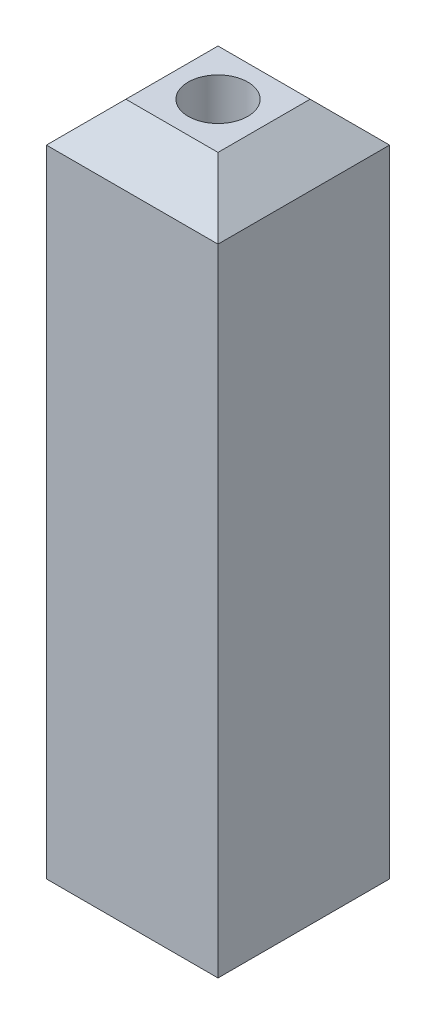
ISO-10303-21;
HEADER;
FILE_DESCRIPTION(('STEP AP214'),'2;1');
FILE_NAME('part.step','',(''),(''),'','','');
FILE_SCHEMA(('AUTOMOTIVE_DESIGN { 1 0 10303 214 1 1 1 1 }'));
ENDSEC;
DATA;
#1=APPLICATION_CONTEXT('core data for automotive mechanical design processes');
#2=APPLICATION_PROTOCOL_DEFINITION('international standard','automotive_design',2000,#1);
#3=PRODUCT_CONTEXT('',#1,'mechanical');
#4=PRODUCT('Part','Part','',(#3));
#5=PRODUCT_RELATED_PRODUCT_CATEGORY('part','',(#4));
#6=PRODUCT_DEFINITION_FORMATION('','',#4);
#7=PRODUCT_DEFINITION_CONTEXT('part definition',#1,'design');
#8=PRODUCT_DEFINITION('design','',#6,#7);
#9=PRODUCT_DEFINITION_SHAPE('','',#8);
#10=(LENGTH_UNIT() NAMED_UNIT(*) SI_UNIT(.MILLI.,.METRE.));
#11=(NAMED_UNIT(*) PLANE_ANGLE_UNIT() SI_UNIT($,.RADIAN.));
#12=(NAMED_UNIT(*) SI_UNIT($,.STERADIAN.) SOLID_ANGLE_UNIT());
#13=UNCERTAINTY_MEASURE_WITH_UNIT(LENGTH_MEASURE(1.E-05),#10,'distance_accuracy_value','');
#14=(GEOMETRIC_REPRESENTATION_CONTEXT(3) GLOBAL_UNCERTAINTY_ASSIGNED_CONTEXT((#13)) GLOBAL_UNIT_ASSIGNED_CONTEXT((#10,
#11,#12)) REPRESENTATION_CONTEXT('',''));
#15=CARTESIAN_POINT('',(0.,0.,0.));
#16=DIRECTION('',(0.,0.,1.));
#17=DIRECTION('',(1.,0.,0.));
#18=AXIS2_PLACEMENT_3D('',#15,#16,#17);
#19=CARTESIAN_POINT('',(-27.432,215.9,-27.432));
#20=DIRECTION('',(0.,0.,-1.));
#21=DIRECTION('',(-1.,0.,0.));
#22=AXIS2_PLACEMENT_3D('',#19,#20,#21);
#23=PLANE('',#22);
#24=DIRECTION('',(0.,-1.,0.));
#25=VECTOR('',#24,1.);
#26=CARTESIAN_POINT('',(-27.432,215.9,-27.432));
#27=LINE('',#26,#25);
#28=CARTESIAN_POINT('',(-27.432,203.2,-27.432));
#29=VERTEX_POINT('',#28);
#30=CARTESIAN_POINT('',(-27.432,0.,-27.432));
#31=VERTEX_POINT('',#30);
#32=EDGE_CURVE('E161',#29,#31,#27,.T.);
#33=ORIENTED_EDGE('',*,*,#32,.F.);
#34=DIRECTION('',(1.,0.,0.));
#35=VECTOR('',#34,1.);
#36=CARTESIAN_POINT('',(27.432,203.2,-27.432));
#37=LINE('',#36,#35);
#38=CARTESIAN_POINT('',(27.432,203.2,-27.432));
#39=VERTEX_POINT('',#38);
#40=EDGE_CURVE('E11',#29,#39,#37,.T.);
#41=ORIENTED_EDGE('',*,*,#40,.T.);
#42=DIRECTION('',(0.,-1.,0.));
#43=VECTOR('',#42,1.);
#44=CARTESIAN_POINT('',(27.432,215.9,-27.432));
#45=LINE('',#44,#43);
#46=CARTESIAN_POINT('',(27.432,0.,-27.432));
#47=VERTEX_POINT('',#46);
#48=EDGE_CURVE('E160',#39,#47,#45,.T.);
#49=ORIENTED_EDGE('',*,*,#48,.T.);
#50=DIRECTION('',(1.,0.,0.));
#51=VECTOR('',#50,1.);
#52=CARTESIAN_POINT('',(-27.432,0.,-27.432));
#53=LINE('',#52,#51);
#54=EDGE_CURVE('E148',#31,#47,#53,.T.);
#55=ORIENTED_EDGE('',*,*,#54,.F.);
#56=EDGE_LOOP('',(#33,#41,#49,#55));
#57=FACE_BOUND('',#56,.T.);
#58=ADVANCED_FACE('F33',(#57),#23,.T.);
#59=CARTESIAN_POINT('',(-27.432,215.9,-27.432));
#60=DIRECTION('',(1.,0.,0.));
#61=DIRECTION('',(0.,0.,-1.));
#62=AXIS2_PLACEMENT_3D('',#59,#60,#61);
#63=PLANE('',#62);
#64=DIRECTION('',(0.,-1.,0.));
#65=VECTOR('',#64,1.);
#66=CARTESIAN_POINT('',(-27.432,215.9,27.432));
#67=LINE('',#66,#65);
#68=CARTESIAN_POINT('',(-27.432,203.2,27.432));
#69=VERTEX_POINT('',#68);
#70=CARTESIAN_POINT('',(-27.432,0.,27.432));
#71=VERTEX_POINT('',#70);
#72=EDGE_CURVE('E164',#69,#71,#67,.T.);
#73=ORIENTED_EDGE('',*,*,#72,.F.);
#74=DIRECTION('',(0.,0.,-1.));
#75=VECTOR('',#74,1.);
#76=CARTESIAN_POINT('',(-27.432,203.2,-27.432));
#77=LINE('',#76,#75);
#78=EDGE_CURVE('E56',#69,#29,#77,.T.);
#79=ORIENTED_EDGE('',*,*,#78,.T.);
#80=ORIENTED_EDGE('',*,*,#32,.T.);
#81=DIRECTION('',(0.,0.,1.));
#82=VECTOR('',#81,1.);
#83=CARTESIAN_POINT('',(-27.432,0.,-27.432));
#84=LINE('',#83,#82);
#85=EDGE_CURVE('E157',#31,#71,#84,.T.);
#86=ORIENTED_EDGE('',*,*,#85,.T.);
#87=EDGE_LOOP('',(#73,#79,#80,#86));
#88=FACE_BOUND('',#87,.T.);
#89=ADVANCED_FACE('F226',(#88),#63,.F.);
#90=CARTESIAN_POINT('',(-27.432,215.9,27.432));
#91=DIRECTION('',(0.,0.,-1.));
#92=DIRECTION('',(-1.,0.,0.));
#93=AXIS2_PLACEMENT_3D('',#90,#91,#92);
#94=PLANE('',#93);
#95=DIRECTION('',(0.,-1.,0.));
#96=VECTOR('',#95,1.);
#97=CARTESIAN_POINT('',(27.432,215.9,27.432));
#98=LINE('',#97,#96);
#99=CARTESIAN_POINT('',(27.432,203.2,27.432));
#100=VERTEX_POINT('',#99);
#101=CARTESIAN_POINT('',(27.432,0.,27.432));
#102=VERTEX_POINT('',#101);
#103=EDGE_CURVE('E166',#100,#102,#98,.T.);
#104=ORIENTED_EDGE('',*,*,#103,.F.);
#105=DIRECTION('',(-1.,0.,0.));
#106=VECTOR('',#105,1.);
#107=CARTESIAN_POINT('',(-27.432,203.2,27.432));
#108=LINE('',#107,#106);
#109=EDGE_CURVE('E177',#100,#69,#108,.T.);
#110=ORIENTED_EDGE('',*,*,#109,.T.);
#111=ORIENTED_EDGE('',*,*,#72,.T.);
#112=DIRECTION('',(1.,0.,0.));
#113=VECTOR('',#112,1.);
#114=CARTESIAN_POINT('',(-27.432,0.,27.432));
#115=LINE('',#114,#113);
#116=EDGE_CURVE('E154',#71,#102,#115,.T.);
#117=ORIENTED_EDGE('',*,*,#116,.T.);
#118=EDGE_LOOP('',(#104,#110,#111,#117));
#119=FACE_BOUND('',#118,.T.);
#120=ADVANCED_FACE('F207',(#119),#94,.F.);
#121=CARTESIAN_POINT('',(27.432,215.9,-27.432));
#122=DIRECTION('',(1.,0.,0.));
#123=DIRECTION('',(0.,0.,-1.));
#124=AXIS2_PLACEMENT_3D('',#121,#122,#123);
#125=PLANE('',#124);
#126=ORIENTED_EDGE('',*,*,#48,.F.);
#127=DIRECTION('',(0.,0.,1.));
#128=VECTOR('',#127,1.);
#129=CARTESIAN_POINT('',(27.432,203.2,27.432));
#130=LINE('',#129,#128);
#131=EDGE_CURVE('E42',#39,#100,#130,.T.);
#132=ORIENTED_EDGE('',*,*,#131,.T.);
#133=ORIENTED_EDGE('',*,*,#103,.T.);
#134=DIRECTION('',(0.,0.,1.));
#135=VECTOR('',#134,1.);
#136=CARTESIAN_POINT('',(27.432,0.,-27.432));
#137=LINE('',#136,#135);
#138=EDGE_CURVE('E151',#47,#102,#137,.T.);
#139=ORIENTED_EDGE('',*,*,#138,.F.);
#140=EDGE_LOOP('',(#126,#132,#133,#139));
#141=FACE_BOUND('',#140,.T.);
#142=ADVANCED_FACE('F203',(#141),#125,.T.);
#143=CARTESIAN_POINT('',(0.,215.9,0.));
#144=DIRECTION('',(0.,-1.,0.));
#145=DIRECTION('',(0.,0.,-1.));
#146=AXIS2_PLACEMENT_3D('',#143,#144,#145);
#147=PLANE('',#146);
#148=DIRECTION('',(0.,0.,1.));
#149=VECTOR('',#148,1.);
#150=CARTESIAN_POINT('',(-14.7319999999999,215.9,0.));
#151=LINE('',#150,#149);
#152=CARTESIAN_POINT('',(-14.7319999999999,215.9,-14.7319999999999));
#153=VERTEX_POINT('',#152);
#154=CARTESIAN_POINT('',(-14.7319999999999,215.9,14.7319999999999));
#155=VERTEX_POINT('',#154);
#156=EDGE_CURVE('E172',#153,#155,#151,.T.);
#157=ORIENTED_EDGE('',*,*,#156,.T.);
#158=DIRECTION('',(1.,0.,0.));
#159=VECTOR('',#158,1.);
#160=CARTESIAN_POINT('',(0.,215.9,14.7319999999999));
#161=LINE('',#160,#159);
#162=CARTESIAN_POINT('',(14.7319999999999,215.9,14.7319999999999));
#163=VERTEX_POINT('',#162);
#164=EDGE_CURVE('E174',#155,#163,#161,.T.);
#165=ORIENTED_EDGE('',*,*,#164,.T.);
#166=DIRECTION('',(0.,0.,-1.));
#167=VECTOR('',#166,1.);
#168=CARTESIAN_POINT('',(14.7319999999999,215.9,-27.432));
#169=LINE('',#168,#167);
#170=CARTESIAN_POINT('',(14.7319999999999,215.9,-14.7319999999999));
#171=VERTEX_POINT('',#170);
#172=EDGE_CURVE('E170',#163,#171,#169,.T.);
#173=ORIENTED_EDGE('',*,*,#172,.T.);
#174=DIRECTION('',(-1.,0.,0.));
#175=VECTOR('',#174,1.);
#176=CARTESIAN_POINT('',(-27.432,215.9,-14.7319999999999));
#177=LINE('',#176,#175);
#178=EDGE_CURVE('E163',#171,#153,#177,.T.);
#179=ORIENTED_EDGE('',*,*,#178,.T.);
#180=EDGE_LOOP('',(#157,#165,#173,#179));
#181=FACE_BOUND('',#180,.T.);
#182=CARTESIAN_POINT('',(0.,215.9,0.));
#183=DIRECTION('',(0.,1.,0.));
#184=DIRECTION('',(0.,0.,1.));
#185=AXIS2_PLACEMENT_3D('',#182,#183,#184);
#186=CIRCLE('',#185,9.52499999999998);
#187=CARTESIAN_POINT('',(0.,215.9,9.52499999999998));
#188=VERTEX_POINT('',#187);
#189=EDGE_CURVE('E114',#188,#188,#186,.T.);
#190=ORIENTED_EDGE('',*,*,#189,.F.);
#191=EDGE_LOOP('',(#190));
#192=FACE_BOUND('',#191,.T.);
#193=ADVANCED_FACE('F213',(#181,#192),#147,.F.);
#194=CARTESIAN_POINT('',(0.,0.,0.));
#195=DIRECTION('',(0.,-1.,0.));
#196=DIRECTION('',(0.,0.,-1.));
#197=AXIS2_PLACEMENT_3D('',#194,#195,#196);
#198=PLANE('',#197);
#199=CARTESIAN_POINT('',(-23.622,0.,23.622));
#200=DIRECTION('',(0.,-1.,0.));
#201=DIRECTION('',(0.,0.,-1.));
#202=AXIS2_PLACEMENT_3D('',#199,#200,#201);
#203=CIRCLE('',#202,2.57975099999998);
#204=CARTESIAN_POINT('',(-23.622,0.,21.042249));
#205=VERTEX_POINT('',#204);
#206=EDGE_CURVE('E113',#205,#205,#203,.T.);
#207=ORIENTED_EDGE('',*,*,#206,.F.);
#208=EDGE_LOOP('',(#207));
#209=FACE_BOUND('',#208,.T.);
#210=CARTESIAN_POINT('',(23.622,0.,23.622));
#211=DIRECTION('',(0.,-1.,0.));
#212=DIRECTION('',(0.,0.,-1.));
#213=AXIS2_PLACEMENT_3D('',#210,#211,#212);
#214=CIRCLE('',#213,2.57975099999998);
#215=CARTESIAN_POINT('',(23.622,0.,21.042249));
#216=VERTEX_POINT('',#215);
#217=EDGE_CURVE('E124',#216,#216,#214,.T.);
#218=ORIENTED_EDGE('',*,*,#217,.F.);
#219=EDGE_LOOP('',(#218));
#220=FACE_BOUND('',#219,.T.);
#221=CARTESIAN_POINT('',(23.622,0.,-23.622));
#222=DIRECTION('',(0.,-1.,0.));
#223=DIRECTION('',(0.,0.,-1.));
#224=AXIS2_PLACEMENT_3D('',#221,#222,#223);
#225=CIRCLE('',#224,2.57975099999998);
#226=CARTESIAN_POINT('',(23.622,0.,-26.201751));
#227=VERTEX_POINT('',#226);
#228=EDGE_CURVE('E130',#227,#227,#225,.T.);
#229=ORIENTED_EDGE('',*,*,#228,.F.);
#230=EDGE_LOOP('',(#229));
#231=FACE_BOUND('',#230,.T.);
#232=CARTESIAN_POINT('',(-23.622,0.,-23.622));
#233=DIRECTION('',(0.,-1.,0.));
#234=DIRECTION('',(0.,0.,-1.));
#235=AXIS2_PLACEMENT_3D('',#232,#233,#234);
#236=CIRCLE('',#235,2.57975099999998);
#237=CARTESIAN_POINT('',(-23.622,0.,-26.201751));
#238=VERTEX_POINT('',#237);
#239=EDGE_CURVE('E136',#238,#238,#236,.T.);
#240=ORIENTED_EDGE('',*,*,#239,.F.);
#241=EDGE_LOOP('',(#240));
#242=FACE_BOUND('',#241,.T.);
#243=CARTESIAN_POINT('',(0.,0.,0.));
#244=DIRECTION('',(0.,-1.,0.));
#245=DIRECTION('',(0.,0.,-1.));
#246=AXIS2_PLACEMENT_3D('',#243,#244,#245);
#247=CIRCLE('',#246,9.52499999999999);
#248=CARTESIAN_POINT('',(0.,0.,-9.52499999999999));
#249=VERTEX_POINT('',#248);
#250=EDGE_CURVE('E142',#249,#249,#247,.T.);
#251=ORIENTED_EDGE('',*,*,#250,.F.);
#252=EDGE_LOOP('',(#251));
#253=FACE_BOUND('',#252,.T.);
#254=ORIENTED_EDGE('',*,*,#54,.T.);
#255=ORIENTED_EDGE('',*,*,#138,.T.);
#256=ORIENTED_EDGE('',*,*,#116,.F.);
#257=ORIENTED_EDGE('',*,*,#85,.F.);
#258=EDGE_LOOP('',(#254,#255,#256,#257));
#259=FACE_BOUND('',#258,.T.);
#260=ADVANCED_FACE('F216',(#209,#220,#231,#242,#253,#259),#198,.T.);
#261=CARTESIAN_POINT('',(0.,152.4,0.));
#262=DIRECTION('',(0.,-1.,0.));
#263=DIRECTION('',(0.,0.,-1.));
#264=AXIS2_PLACEMENT_3D('',#261,#262,#263);
#265=CONICAL_SURFACE('',#264,9.52499999999998,1.02974425867665);
#266=CARTESIAN_POINT('',(0.,158.123197396238,0.));
#267=VERTEX_POINT('',#266);
#268=VERTEX_LOOP('',#267);
#269=FACE_BOUND('',#268,.T.);
#270=CARTESIAN_POINT('',(0.,152.4,0.));
#271=DIRECTION('',(0.,-1.,0.));
#272=DIRECTION('',(0.,0.,-1.));
#273=AXIS2_PLACEMENT_3D('',#270,#271,#272);
#274=CIRCLE('',#273,9.52499999999998);
#275=CARTESIAN_POINT('',(0.,152.4,-9.52499999999998));
#276=VERTEX_POINT('',#275);
#277=EDGE_CURVE('E145',#276,#276,#274,.T.);
#278=ORIENTED_EDGE('',*,*,#277,.T.);
#279=EDGE_LOOP('',(#278));
#280=FACE_BOUND('',#279,.T.);
#281=ADVANCED_FACE('F351',(#269,#280),#265,.F.);
#282=CARTESIAN_POINT('',(0.,0.,0.));
#283=DIRECTION('',(0.,-1.,0.));
#284=DIRECTION('',(0.,0.,-1.));
#285=AXIS2_PLACEMENT_3D('',#282,#283,#284);
#286=CYLINDRICAL_SURFACE('',#285,9.52499999999998);
#287=ORIENTED_EDGE('',*,*,#277,.F.);
#288=EDGE_LOOP('',(#287));
#289=FACE_BOUND('',#288,.T.);
#290=ORIENTED_EDGE('',*,*,#250,.T.);
#291=EDGE_LOOP('',(#290));
#292=FACE_BOUND('',#291,.T.);
#293=ADVANCED_FACE('F341',(#289,#292),#286,.F.);
#294=CARTESIAN_POINT('',(-23.622,152.4,-23.622));
#295=DIRECTION('',(0.,-1.,0.));
#296=DIRECTION('',(0.,0.,-1.));
#297=AXIS2_PLACEMENT_3D('',#294,#295,#296);
#298=CONICAL_SURFACE('',#297,2.57975099999996,1.02974425867664);
#299=CARTESIAN_POINT('',(-23.622,153.950070782797,-23.622));
#300=VERTEX_POINT('',#299);
#301=VERTEX_LOOP('',#300);
#302=FACE_BOUND('',#301,.T.);
#303=CARTESIAN_POINT('',(-23.622,152.4,-23.622));
#304=DIRECTION('',(0.,-1.,0.));
#305=DIRECTION('',(0.,0.,-1.));
#306=AXIS2_PLACEMENT_3D('',#303,#304,#305);
#307=CIRCLE('',#306,2.57975099999996);
#308=CARTESIAN_POINT('',(-23.622,152.4,-26.201751));
#309=VERTEX_POINT('',#308);
#310=EDGE_CURVE('E139',#309,#309,#307,.T.);
#311=ORIENTED_EDGE('',*,*,#310,.T.);
#312=EDGE_LOOP('',(#311));
#313=FACE_BOUND('',#312,.T.);
#314=ADVANCED_FACE('F332',(#302,#313),#298,.F.);
#315=CARTESIAN_POINT('',(-23.622,0.,-23.622));
#316=DIRECTION('',(0.,-1.,0.));
#317=DIRECTION('',(0.,0.,-1.));
#318=AXIS2_PLACEMENT_3D('',#315,#316,#317);
#319=CYLINDRICAL_SURFACE('',#318,2.57975099999997);
#320=ORIENTED_EDGE('',*,*,#310,.F.);
#321=EDGE_LOOP('',(#320));
#322=FACE_BOUND('',#321,.T.);
#323=ORIENTED_EDGE('',*,*,#239,.T.);
#324=EDGE_LOOP('',(#323));
#325=FACE_BOUND('',#324,.T.);
#326=ADVANCED_FACE('F323',(#322,#325),#319,.F.);
#327=CARTESIAN_POINT('',(23.622,152.4,-23.622));
#328=DIRECTION('',(0.,-1.,0.));
#329=DIRECTION('',(0.,0.,-1.));
#330=AXIS2_PLACEMENT_3D('',#327,#328,#329);
#331=CONICAL_SURFACE('',#330,2.57975099999996,1.02974425867664);
#332=CARTESIAN_POINT('',(23.622,153.950070782797,-23.622));
#333=VERTEX_POINT('',#332);
#334=VERTEX_LOOP('',#333);
#335=FACE_BOUND('',#334,.T.);
#336=CARTESIAN_POINT('',(23.622,152.4,-23.622));
#337=DIRECTION('',(0.,-1.,0.));
#338=DIRECTION('',(0.,0.,-1.));
#339=AXIS2_PLACEMENT_3D('',#336,#337,#338);
#340=CIRCLE('',#339,2.57975099999996);
#341=CARTESIAN_POINT('',(23.622,152.4,-26.201751));
#342=VERTEX_POINT('',#341);
#343=EDGE_CURVE('E133',#342,#342,#340,.T.);
#344=ORIENTED_EDGE('',*,*,#343,.T.);
#345=EDGE_LOOP('',(#344));
#346=FACE_BOUND('',#345,.T.);
#347=ADVANCED_FACE('F314',(#335,#346),#331,.F.);
#348=CARTESIAN_POINT('',(23.622,0.,-23.622));
#349=DIRECTION('',(0.,-1.,0.));
#350=DIRECTION('',(0.,0.,-1.));
#351=AXIS2_PLACEMENT_3D('',#348,#349,#350);
#352=CYLINDRICAL_SURFACE('',#351,2.57975099999997);
#353=ORIENTED_EDGE('',*,*,#343,.F.);
#354=EDGE_LOOP('',(#353));
#355=FACE_BOUND('',#354,.T.);
#356=ORIENTED_EDGE('',*,*,#228,.T.);
#357=EDGE_LOOP('',(#356));
#358=FACE_BOUND('',#357,.T.);
#359=ADVANCED_FACE('F305',(#355,#358),#352,.F.);
#360=CARTESIAN_POINT('',(23.622,152.4,23.622));
#361=DIRECTION('',(0.,-1.,0.));
#362=DIRECTION('',(0.,0.,-1.));
#363=AXIS2_PLACEMENT_3D('',#360,#361,#362);
#364=CONICAL_SURFACE('',#363,2.57975099999996,1.02974425867664);
#365=CARTESIAN_POINT('',(23.622,153.950070782797,23.622));
#366=VERTEX_POINT('',#365);
#367=VERTEX_LOOP('',#366);
#368=FACE_BOUND('',#367,.T.);
#369=CARTESIAN_POINT('',(23.622,152.4,23.622));
#370=DIRECTION('',(0.,-1.,0.));
#371=DIRECTION('',(0.,0.,-1.));
#372=AXIS2_PLACEMENT_3D('',#369,#370,#371);
#373=CIRCLE('',#372,2.57975099999996);
#374=CARTESIAN_POINT('',(23.622,152.4,21.042249));
#375=VERTEX_POINT('',#374);
#376=EDGE_CURVE('E127',#375,#375,#373,.T.);
#377=ORIENTED_EDGE('',*,*,#376,.T.);
#378=EDGE_LOOP('',(#377));
#379=FACE_BOUND('',#378,.T.);
#380=ADVANCED_FACE('F296',(#368,#379),#364,.F.);
#381=CARTESIAN_POINT('',(23.622,0.,23.622));
#382=DIRECTION('',(0.,-1.,0.));
#383=DIRECTION('',(0.,0.,-1.));
#384=AXIS2_PLACEMENT_3D('',#381,#382,#383);
#385=CYLINDRICAL_SURFACE('',#384,2.57975099999997);
#386=ORIENTED_EDGE('',*,*,#376,.F.);
#387=EDGE_LOOP('',(#386));
#388=FACE_BOUND('',#387,.T.);
#389=ORIENTED_EDGE('',*,*,#217,.T.);
#390=EDGE_LOOP('',(#389));
#391=FACE_BOUND('',#390,.T.);
#392=ADVANCED_FACE('F287',(#388,#391),#385,.F.);
#393=CARTESIAN_POINT('',(-23.622,152.4,23.622));
#394=DIRECTION('',(0.,-1.,0.));
#395=DIRECTION('',(0.,0.,-1.));
#396=AXIS2_PLACEMENT_3D('',#393,#394,#395);
#397=CONICAL_SURFACE('',#396,2.57975099999996,1.02974425867664);
#398=CARTESIAN_POINT('',(-23.622,153.950070782797,23.622));
#399=VERTEX_POINT('',#398);
#400=VERTEX_LOOP('',#399);
#401=FACE_BOUND('',#400,.T.);
#402=CARTESIAN_POINT('',(-23.622,152.4,23.622));
#403=DIRECTION('',(0.,-1.,0.));
#404=DIRECTION('',(0.,0.,-1.));
#405=AXIS2_PLACEMENT_3D('',#402,#403,#404);
#406=CIRCLE('',#405,2.57975099999996);
#407=CARTESIAN_POINT('',(-23.622,152.4,21.042249));
#408=VERTEX_POINT('',#407);
#409=EDGE_CURVE('E117',#408,#408,#406,.T.);
#410=ORIENTED_EDGE('',*,*,#409,.T.);
#411=EDGE_LOOP('',(#410));
#412=FACE_BOUND('',#411,.T.);
#413=ADVANCED_FACE('F278',(#401,#412),#397,.F.);
#414=CARTESIAN_POINT('',(-23.622,0.,23.622));
#415=DIRECTION('',(0.,-1.,0.));
#416=DIRECTION('',(0.,0.,-1.));
#417=AXIS2_PLACEMENT_3D('',#414,#415,#416);
#418=CYLINDRICAL_SURFACE('',#417,2.57975099999997);
#419=ORIENTED_EDGE('',*,*,#409,.F.);
#420=EDGE_LOOP('',(#419));
#421=FACE_BOUND('',#420,.T.);
#422=ORIENTED_EDGE('',*,*,#206,.T.);
#423=EDGE_LOOP('',(#422));
#424=FACE_BOUND('',#423,.T.);
#425=ADVANCED_FACE('F107',(#421,#424),#418,.F.);
#426=CARTESIAN_POINT('',(0.,173.355,0.));
#427=DIRECTION('',(0.,1.,0.));
#428=DIRECTION('',(0.,0.,1.));
#429=AXIS2_PLACEMENT_3D('',#426,#427,#428);
#430=CONICAL_SURFACE('',#429,9.52499999999997,1.02974425867665);
#431=CARTESIAN_POINT('',(0.,167.631802603762,0.));
#432=VERTEX_POINT('',#431);
#433=VERTEX_LOOP('',#432);
#434=FACE_BOUND('',#433,.T.);
#435=CARTESIAN_POINT('',(0.,173.355,0.));
#436=DIRECTION('',(0.,1.,0.));
#437=DIRECTION('',(0.,0.,1.));
#438=AXIS2_PLACEMENT_3D('',#435,#436,#437);
#439=CIRCLE('',#438,9.52499999999997);
#440=CARTESIAN_POINT('',(0.,173.355,9.52499999999997));
#441=VERTEX_POINT('',#440);
#442=EDGE_CURVE('E111',#441,#441,#439,.T.);
#443=ORIENTED_EDGE('',*,*,#442,.T.);
#444=EDGE_LOOP('',(#443));
#445=FACE_BOUND('',#444,.T.);
#446=ADVANCED_FACE('F103',(#434,#445),#430,.F.);
#447=CARTESIAN_POINT('',(0.,215.9,0.));
#448=DIRECTION('',(0.,1.,0.));
#449=DIRECTION('',(0.,0.,1.));
#450=AXIS2_PLACEMENT_3D('',#447,#448,#449);
#451=CYLINDRICAL_SURFACE('',#450,9.52499999999998);
#452=ORIENTED_EDGE('',*,*,#442,.F.);
#453=EDGE_LOOP('',(#452));
#454=FACE_BOUND('',#453,.T.);
#455=ORIENTED_EDGE('',*,*,#189,.T.);
#456=EDGE_LOOP('',(#455));
#457=FACE_BOUND('',#456,.T.);
#458=ADVANCED_FACE('F106',(#454,#457),#451,.F.);
#459=CARTESIAN_POINT('',(-27.432,203.2,-27.432));
#460=DIRECTION('',(0.,0.70710678118655,-0.707106781186545));
#461=DIRECTION('',(-1.,0.,0.));
#462=AXIS2_PLACEMENT_3D('',#459,#460,#461);
#463=PLANE('',#462);
#464=DIRECTION('',(0.577350269189627,-0.577350269189623,-0.577350269189627));
#465=VECTOR('',#464,1.);
#466=CARTESIAN_POINT('',(9.14399999999992,221.488,-9.14399999999993));
#467=LINE('',#466,#465);
#468=EDGE_CURVE('E185',#39,#171,#467,.F.);
#469=ORIENTED_EDGE('',*,*,#468,.F.);
#470=ORIENTED_EDGE('',*,*,#40,.F.);
#471=DIRECTION('',(-0.577350269189627,-0.577350269189623,-0.577350269189627));
#472=VECTOR('',#471,1.);
#473=CARTESIAN_POINT('',(-27.432,203.2,-27.432));
#474=LINE('',#473,#472);
#475=EDGE_CURVE('E37',#153,#29,#474,.T.);
#476=ORIENTED_EDGE('',*,*,#475,.F.);
#477=ORIENTED_EDGE('',*,*,#178,.F.);
#478=EDGE_LOOP('',(#469,#470,#476,#477));
#479=FACE_BOUND('',#478,.T.);
#480=ADVANCED_FACE('F35',(#479),#463,.T.);
#481=CARTESIAN_POINT('',(-14.7319999999999,215.9,0.));
#482=DIRECTION('',(0.707106781186545,-0.70710678118655,0.));
#483=DIRECTION('',(0.,0.,1.));
#484=AXIS2_PLACEMENT_3D('',#481,#482,#483);
#485=PLANE('',#484);
#486=ORIENTED_EDGE('',*,*,#475,.T.);
#487=ORIENTED_EDGE('',*,*,#78,.F.);
#488=DIRECTION('',(0.577350269189627,0.577350269189623,-0.577350269189627));
#489=VECTOR('',#488,1.);
#490=CARTESIAN_POINT('',(-9.82133333333325,220.810666666667,9.82133333333324));
#491=LINE('',#490,#489);
#492=EDGE_CURVE('E184',#155,#69,#491,.F.);
#493=ORIENTED_EDGE('',*,*,#492,.F.);
#494=ORIENTED_EDGE('',*,*,#156,.F.);
#495=EDGE_LOOP('',(#486,#487,#493,#494));
#496=FACE_BOUND('',#495,.T.);
#497=ADVANCED_FACE('F195',(#496),#485,.F.);
#498=CARTESIAN_POINT('',(27.432,203.2,-27.432));
#499=DIRECTION('',(0.707106781186545,0.70710678118655,0.));
#500=DIRECTION('',(0.,0.,-1.));
#501=AXIS2_PLACEMENT_3D('',#498,#499,#500);
#502=PLANE('',#501);
#503=ORIENTED_EDGE('',*,*,#468,.T.);
#504=ORIENTED_EDGE('',*,*,#172,.F.);
#505=DIRECTION('',(-0.577350269189627,0.577350269189623,-0.577350269189627));
#506=VECTOR('',#505,1.);
#507=CARTESIAN_POINT('',(9.14399999999992,221.488,9.14399999999992));
#508=LINE('',#507,#506);
#509=EDGE_CURVE('E182',#100,#163,#508,.T.);
#510=ORIENTED_EDGE('',*,*,#509,.F.);
#511=ORIENTED_EDGE('',*,*,#131,.F.);
#512=EDGE_LOOP('',(#503,#504,#510,#511));
#513=FACE_BOUND('',#512,.T.);
#514=ADVANCED_FACE('F200',(#513),#502,.T.);
#515=CARTESIAN_POINT('',(0.,215.9,14.7319999999999));
#516=DIRECTION('',(0.,-0.70710678118655,-0.707106781186545));
#517=DIRECTION('',(1.,0.,0.));
#518=AXIS2_PLACEMENT_3D('',#515,#516,#517);
#519=PLANE('',#518);
#520=ORIENTED_EDGE('',*,*,#492,.T.);
#521=ORIENTED_EDGE('',*,*,#109,.F.);
#522=ORIENTED_EDGE('',*,*,#509,.T.);
#523=ORIENTED_EDGE('',*,*,#164,.F.);
#524=EDGE_LOOP('',(#520,#521,#522,#523));
#525=FACE_BOUND('',#524,.T.);
#526=ADVANCED_FACE('F210',(#525),#519,.F.);
#527=CLOSED_SHELL('',(#58,#89,#120,#142,#193,#260,#281,#293,#314,#326,#347,#359,#380,#392,#413,
#425,#446,#458,#480,#497,#514,#526));
#528=MANIFOLD_SOLID_BREP('B2',#527);
#529=ADVANCED_BREP_SHAPE_REPRESENTATION('',(#18,#528),#14);
#530=SHAPE_DEFINITION_REPRESENTATION(#9,#529);
ENDSEC;
END-ISO-10303-21;
